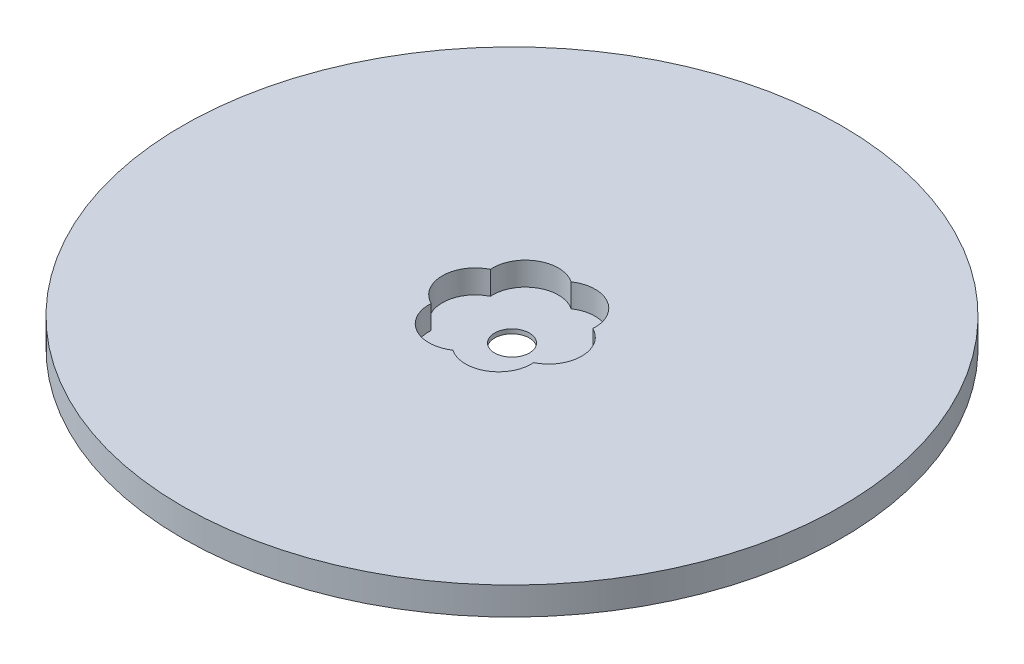
ISO-10303-21;
HEADER;
FILE_DESCRIPTION(('STEP AP214'),'2;1');
FILE_NAME('part.step','',(''),(''),'','','');
FILE_SCHEMA(('AUTOMOTIVE_DESIGN { 1 0 10303 214 1 1 1 1 }'));
ENDSEC;
DATA;
#1=APPLICATION_CONTEXT('core data for automotive mechanical design processes');
#2=APPLICATION_PROTOCOL_DEFINITION('international standard','automotive_design',2000,#1);
#3=PRODUCT_CONTEXT('',#1,'mechanical');
#4=PRODUCT('Part','Part','',(#3));
#5=PRODUCT_RELATED_PRODUCT_CATEGORY('part','',(#4));
#6=PRODUCT_DEFINITION_FORMATION('','',#4);
#7=PRODUCT_DEFINITION_CONTEXT('part definition',#1,'design');
#8=PRODUCT_DEFINITION('design','',#6,#7);
#9=PRODUCT_DEFINITION_SHAPE('','',#8);
#10=(LENGTH_UNIT() NAMED_UNIT(*) SI_UNIT(.MILLI.,.METRE.));
#11=(NAMED_UNIT(*) PLANE_ANGLE_UNIT() SI_UNIT($,.RADIAN.));
#12=(NAMED_UNIT(*) SI_UNIT($,.STERADIAN.) SOLID_ANGLE_UNIT());
#13=UNCERTAINTY_MEASURE_WITH_UNIT(LENGTH_MEASURE(1.E-05),#10,'distance_accuracy_value','');
#14=(GEOMETRIC_REPRESENTATION_CONTEXT(3) GLOBAL_UNCERTAINTY_ASSIGNED_CONTEXT((#13)) GLOBAL_UNIT_ASSIGNED_CONTEXT((#10,
#11,#12)) REPRESENTATION_CONTEXT('',''));
#15=CARTESIAN_POINT('',(0.,0.,0.));
#16=DIRECTION('',(0.,0.,1.));
#17=DIRECTION('',(1.,0.,0.));
#18=AXIS2_PLACEMENT_3D('',#15,#16,#17);
#19=CARTESIAN_POINT('',(0.,8.,0.));
#20=DIRECTION('',(0.,-1.,0.));
#21=DIRECTION('',(0.,0.,-1.));
#22=AXIS2_PLACEMENT_3D('',#19,#20,#21);
#23=CYLINDRICAL_SURFACE('',#22,5.);
#24=CARTESIAN_POINT('',(0.,0.,0.));
#25=DIRECTION('',(0.,1.,0.));
#26=DIRECTION('',(0.,0.,1.));
#27=AXIS2_PLACEMENT_3D('',#24,#25,#26);
#28=CIRCLE('',#27,5.);
#29=CARTESIAN_POINT('',(0.,0.,5.));
#30=VERTEX_POINT('',#29);
#31=EDGE_CURVE('E143',#30,#30,#28,.T.);
#32=ORIENTED_EDGE('',*,*,#31,.F.);
#33=EDGE_LOOP('',(#32));
#34=FACE_BOUND('',#33,.T.);
#35=CARTESIAN_POINT('',(0.,1.25601425030727,0.));
#36=DIRECTION('',(0.,1.,0.));
#37=DIRECTION('',(0.,0.,1.));
#38=AXIS2_PLACEMENT_3D('',#35,#36,#37);
#39=CIRCLE('',#38,5.);
#40=CARTESIAN_POINT('',(0.,1.25601425030727,5.));
#41=VERTEX_POINT('',#40);
#42=EDGE_CURVE('E11',#41,#41,#39,.T.);
#43=ORIENTED_EDGE('',*,*,#42,.T.);
#44=EDGE_LOOP('',(#43));
#45=FACE_BOUND('',#44,.T.);
#46=ADVANCED_FACE('F39',(#34,#45),#23,.F.);
#47=CARTESIAN_POINT('',(0.,8.,0.));
#48=DIRECTION('',(0.,-1.,0.));
#49=DIRECTION('',(0.,0.,-1.));
#50=AXIS2_PLACEMENT_3D('',#47,#48,#49);
#51=CYLINDRICAL_SURFACE('',#50,95.);
#52=CARTESIAN_POINT('',(0.,8.,0.));
#53=DIRECTION('',(0.,1.,0.));
#54=DIRECTION('',(0.,0.,1.));
#55=AXIS2_PLACEMENT_3D('',#52,#53,#54);
#56=CIRCLE('',#55,95.);
#57=CARTESIAN_POINT('',(0.,8.,95.));
#58=VERTEX_POINT('',#57);
#59=EDGE_CURVE('E50',#58,#58,#56,.T.);
#60=ORIENTED_EDGE('',*,*,#59,.F.);
#61=EDGE_LOOP('',(#60));
#62=FACE_BOUND('',#61,.T.);
#63=CARTESIAN_POINT('',(0.,0.,0.));
#64=DIRECTION('',(0.,1.,0.));
#65=DIRECTION('',(0.,0.,1.));
#66=AXIS2_PLACEMENT_3D('',#63,#64,#65);
#67=CIRCLE('',#66,95.);
#68=CARTESIAN_POINT('',(0.,0.,95.));
#69=VERTEX_POINT('',#68);
#70=EDGE_CURVE('E148',#69,#69,#67,.T.);
#71=ORIENTED_EDGE('',*,*,#70,.T.);
#72=EDGE_LOOP('',(#71));
#73=FACE_BOUND('',#72,.T.);
#74=ADVANCED_FACE('F41',(#62,#73),#51,.T.);
#75=CARTESIAN_POINT('',(0.,8.,0.));
#76=DIRECTION('',(0.,1.,0.));
#77=DIRECTION('',(0.,0.,1.));
#78=AXIS2_PLACEMENT_3D('',#75,#76,#77);
#79=PLANE('',#78);
#80=CARTESIAN_POINT('',(-5.29583228975181,8.,-9.17265059421371));
#81=DIRECTION('',(0.,1.,0.));
#82=DIRECTION('',(-0.866025403784433,0.,0.50000000000001));
#83=AXIS2_PLACEMENT_3D('',#80,#81,#82);
#84=CIRCLE('',#83,9.49842682799602);
#85=CARTESIAN_POINT('',(-1.77809156287623E-13,8.,-17.057717021684));
#86=VERTEX_POINT('',#85);
#87=CARTESIAN_POINT('',(-14.7724162713447,8.,-8.52885851084194));
#88=VERTEX_POINT('',#87);
#89=EDGE_CURVE('E53',#86,#88,#84,.T.);
#90=ORIENTED_EDGE('',*,*,#89,.F.);
#91=CARTESIAN_POINT('',(5.29583228975162,8.,-9.17265059421382));
#92=DIRECTION('',(0.,1.,0.));
#93=DIRECTION('',(-0.866025403784443,0.,-0.499999999999992));
#94=AXIS2_PLACEMENT_3D('',#91,#92,#93);
#95=CIRCLE('',#94,9.49842682799602);
#96=CARTESIAN_POINT('',(14.7724162713445,8.,-8.52885851084203));
#97=VERTEX_POINT('',#96);
#98=EDGE_CURVE('E106',#97,#86,#95,.T.);
#99=ORIENTED_EDGE('',*,*,#98,.F.);
#100=CARTESIAN_POINT('',(10.5916645795034,8.,0.));
#101=DIRECTION('',(0.,1.,0.));
#102=DIRECTION('',(0.,0.,-1.));
#103=AXIS2_PLACEMENT_3D('',#100,#101,#102);
#104=CIRCLE('',#103,9.49842682799602);
#105=CARTESIAN_POINT('',(14.7724162713446,8.,8.52885851084197));
#106=VERTEX_POINT('',#105);
#107=EDGE_CURVE('E104',#106,#97,#104,.T.);
#108=ORIENTED_EDGE('',*,*,#107,.F.);
#109=CARTESIAN_POINT('',(5.29583228975174,8.,9.17265059421375));
#110=DIRECTION('',(0.,1.,0.));
#111=DIRECTION('',(0.866025403784436,0.,-0.500000000000004));
#112=AXIS2_PLACEMENT_3D('',#109,#110,#111);
#113=CIRCLE('',#112,9.49842682799602);
#114=CARTESIAN_POINT('',(0.,8.,17.057717021684));
#115=VERTEX_POINT('',#114);
#116=EDGE_CURVE('E123',#115,#106,#113,.T.);
#117=ORIENTED_EDGE('',*,*,#116,.F.);
#118=CARTESIAN_POINT('',(-5.29583228975168,8.,9.17265059421378));
#119=DIRECTION('',(0.,1.,0.));
#120=DIRECTION('',(0.86602540378444,0.,0.499999999999998));
#121=AXIS2_PLACEMENT_3D('',#118,#119,#120);
#122=CIRCLE('',#121,9.49842682799602);
#123=CARTESIAN_POINT('',(-14.7724162713445,8.,8.528858510842));
#124=VERTEX_POINT('',#123);
#125=EDGE_CURVE('E135',#124,#115,#122,.T.);
#126=ORIENTED_EDGE('',*,*,#125,.F.);
#127=CARTESIAN_POINT('',(-10.5916645795034,8.,0.));
#128=DIRECTION('',(0.,1.,0.));
#129=DIRECTION('',(0.,0.,1.));
#130=AXIS2_PLACEMENT_3D('',#127,#128,#129);
#131=CIRCLE('',#130,9.49842682799602);
#132=EDGE_CURVE('E137',#88,#124,#131,.T.);
#133=ORIENTED_EDGE('',*,*,#132,.F.);
#134=EDGE_LOOP('',(#90,#99,#108,#117,#126,#133));
#135=FACE_BOUND('',#134,.T.);
#136=ORIENTED_EDGE('',*,*,#59,.T.);
#137=EDGE_LOOP('',(#136));
#138=FACE_BOUND('',#137,.T.);
#139=ADVANCED_FACE('F154',(#135,#138),#79,.T.);
#140=CARTESIAN_POINT('',(0.,0.,0.));
#141=DIRECTION('',(0.,1.,0.));
#142=DIRECTION('',(0.,0.,1.));
#143=AXIS2_PLACEMENT_3D('',#140,#141,#142);
#144=PLANE('',#143);
#145=ORIENTED_EDGE('',*,*,#31,.T.);
#146=EDGE_LOOP('',(#145));
#147=FACE_BOUND('',#146,.T.);
#148=ORIENTED_EDGE('',*,*,#70,.F.);
#149=EDGE_LOOP('',(#148));
#150=FACE_BOUND('',#149,.T.);
#151=ADVANCED_FACE('F155',(#147,#150),#144,.F.);
#152=CARTESIAN_POINT('',(-10.5916645795034,1.25601425030727,0.));
#153=DIRECTION('',(0.,1.,0.));
#154=DIRECTION('',(0.,0.,1.));
#155=AXIS2_PLACEMENT_3D('',#152,#153,#154);
#156=CYLINDRICAL_SURFACE('',#155,9.49842682799602);
#157=ORIENTED_EDGE('',*,*,#132,.T.);
#158=DIRECTION('',(0.,1.,0.));
#159=VECTOR('',#158,1.);
#160=CARTESIAN_POINT('',(-14.7724162713445,4.62800712515364,8.528858510842));
#161=LINE('',#160,#159);
#162=CARTESIAN_POINT('',(-14.7724162713445,1.25601425030727,8.528858510842));
#163=VERTEX_POINT('',#162);
#164=EDGE_CURVE('E136',#124,#163,#161,.F.);
#165=ORIENTED_EDGE('',*,*,#164,.T.);
#166=CARTESIAN_POINT('',(-10.5916645795034,1.25601425030727,0.));
#167=DIRECTION('',(0.,1.,0.));
#168=DIRECTION('',(0.,0.,1.));
#169=AXIS2_PLACEMENT_3D('',#166,#167,#168);
#170=CIRCLE('',#169,9.49842682799602);
#171=CARTESIAN_POINT('',(-14.7724162713447,1.25601425030727,-8.52885851084194));
#172=VERTEX_POINT('',#171);
#173=EDGE_CURVE('E138',#172,#163,#170,.T.);
#174=ORIENTED_EDGE('',*,*,#173,.F.);
#175=DIRECTION('',(0.,1.,0.));
#176=VECTOR('',#175,1.);
#177=CARTESIAN_POINT('',(-14.7724162713447,4.62800712515364,-8.52885851084194));
#178=LINE('',#177,#176);
#179=EDGE_CURVE('E114',#172,#88,#178,.T.);
#180=ORIENTED_EDGE('',*,*,#179,.T.);
#181=EDGE_LOOP('',(#157,#165,#174,#180));
#182=FACE_BOUND('',#181,.T.);
#183=ADVANCED_FACE('F152',(#182),#156,.F.);
#184=CARTESIAN_POINT('',(-10.5916645795034,1.25601425030727,0.));
#185=DIRECTION('',(0.,1.,0.));
#186=DIRECTION('',(0.,0.,1.));
#187=AXIS2_PLACEMENT_3D('',#184,#185,#186);
#188=PLANE('',#187);
#189=ORIENTED_EDGE('',*,*,#173,.T.);
#190=CARTESIAN_POINT('',(-5.29583228975168,1.25601425030727,9.17265059421378));
#191=DIRECTION('',(0.,1.,0.));
#192=DIRECTION('',(0.86602540378444,0.,0.499999999999998));
#193=AXIS2_PLACEMENT_3D('',#190,#191,#192);
#194=CIRCLE('',#193,9.49842682799602);
#195=CARTESIAN_POINT('',(0.,1.25601425030727,17.057717021684));
#196=VERTEX_POINT('',#195);
#197=EDGE_CURVE('E65',#163,#196,#194,.T.);
#198=ORIENTED_EDGE('',*,*,#197,.T.);
#199=CARTESIAN_POINT('',(5.29583228975174,1.25601425030727,9.17265059421375));
#200=DIRECTION('',(0.,1.,0.));
#201=DIRECTION('',(0.866025403784436,0.,-0.500000000000004));
#202=AXIS2_PLACEMENT_3D('',#199,#200,#201);
#203=CIRCLE('',#202,9.49842682799602);
#204=CARTESIAN_POINT('',(14.7724162713446,1.25601425030727,8.52885851084197));
#205=VERTEX_POINT('',#204);
#206=EDGE_CURVE('E124',#196,#205,#203,.T.);
#207=ORIENTED_EDGE('',*,*,#206,.T.);
#208=CARTESIAN_POINT('',(10.5916645795034,1.25601425030727,0.));
#209=DIRECTION('',(0.,1.,0.));
#210=DIRECTION('',(0.,0.,-1.));
#211=AXIS2_PLACEMENT_3D('',#208,#209,#210);
#212=CIRCLE('',#211,9.49842682799602);
#213=CARTESIAN_POINT('',(14.7724162713445,1.25601425030727,-8.52885851084203));
#214=VERTEX_POINT('',#213);
#215=EDGE_CURVE('E105',#205,#214,#212,.T.);
#216=ORIENTED_EDGE('',*,*,#215,.T.);
#217=CARTESIAN_POINT('',(5.29583228975162,1.25601425030727,-9.17265059421382));
#218=DIRECTION('',(0.,1.,0.));
#219=DIRECTION('',(-0.866025403784443,0.,-0.499999999999992));
#220=AXIS2_PLACEMENT_3D('',#217,#218,#219);
#221=CIRCLE('',#220,9.49842682799602);
#222=CARTESIAN_POINT('',(-1.77809156287623E-13,1.25601425030727,-17.057717021684));
#223=VERTEX_POINT('',#222);
#224=EDGE_CURVE('E91',#214,#223,#221,.T.);
#225=ORIENTED_EDGE('',*,*,#224,.T.);
#226=CARTESIAN_POINT('',(-5.29583228975181,1.25601425030727,-9.17265059421371));
#227=DIRECTION('',(0.,1.,0.));
#228=DIRECTION('',(-0.866025403784433,0.,0.50000000000001));
#229=AXIS2_PLACEMENT_3D('',#226,#227,#228);
#230=CIRCLE('',#229,9.49842682799602);
#231=EDGE_CURVE('E97',#223,#172,#230,.T.);
#232=ORIENTED_EDGE('',*,*,#231,.T.);
#233=EDGE_LOOP('',(#189,#198,#207,#216,#225,#232));
#234=FACE_BOUND('',#233,.T.);
#235=ORIENTED_EDGE('',*,*,#42,.F.);
#236=EDGE_LOOP('',(#235));
#237=FACE_BOUND('',#236,.T.);
#238=ADVANCED_FACE('F96',(#234,#237),#188,.T.);
#239=CARTESIAN_POINT('',(-5.29583228975168,1.25601425030727,9.17265059421378));
#240=DIRECTION('',(0.,1.,0.));
#241=DIRECTION('',(0.,0.,1.));
#242=AXIS2_PLACEMENT_3D('',#239,#240,#241);
#243=CYLINDRICAL_SURFACE('',#242,9.49842682799602);
#244=ORIENTED_EDGE('',*,*,#125,.T.);
#245=DIRECTION('',(0.,1.,0.));
#246=VECTOR('',#245,1.);
#247=CARTESIAN_POINT('',(0.,4.62800712515364,17.057717021684));
#248=LINE('',#247,#246);
#249=EDGE_CURVE('E128',#115,#196,#248,.F.);
#250=ORIENTED_EDGE('',*,*,#249,.T.);
#251=ORIENTED_EDGE('',*,*,#197,.F.);
#252=ORIENTED_EDGE('',*,*,#164,.F.);
#253=EDGE_LOOP('',(#244,#250,#251,#252));
#254=FACE_BOUND('',#253,.T.);
#255=ADVANCED_FACE('F180',(#254),#243,.F.);
#256=CARTESIAN_POINT('',(-5.29583228975181,1.25601425030727,-9.17265059421371));
#257=DIRECTION('',(0.,1.,0.));
#258=DIRECTION('',(0.,0.,1.));
#259=AXIS2_PLACEMENT_3D('',#256,#257,#258);
#260=CYLINDRICAL_SURFACE('',#259,9.49842682799602);
#261=ORIENTED_EDGE('',*,*,#231,.F.);
#262=DIRECTION('',(0.,1.,0.));
#263=VECTOR('',#262,1.);
#264=CARTESIAN_POINT('',(-1.77809156287623E-13,4.62800712515364,-17.057717021684));
#265=LINE('',#264,#263);
#266=EDGE_CURVE('E107',#86,#223,#265,.F.);
#267=ORIENTED_EDGE('',*,*,#266,.F.);
#268=ORIENTED_EDGE('',*,*,#89,.T.);
#269=ORIENTED_EDGE('',*,*,#179,.F.);
#270=EDGE_LOOP('',(#261,#267,#268,#269));
#271=FACE_BOUND('',#270,.T.);
#272=ADVANCED_FACE('F115',(#271),#260,.F.);
#273=CARTESIAN_POINT('',(5.29583228975174,1.25601425030727,9.17265059421375));
#274=DIRECTION('',(0.,1.,0.));
#275=DIRECTION('',(0.,0.,1.));
#276=AXIS2_PLACEMENT_3D('',#273,#274,#275);
#277=CYLINDRICAL_SURFACE('',#276,9.49842682799602);
#278=ORIENTED_EDGE('',*,*,#116,.T.);
#279=DIRECTION('',(0.,1.,0.));
#280=VECTOR('',#279,1.);
#281=CARTESIAN_POINT('',(14.7724162713446,4.62800712515364,8.52885851084197));
#282=LINE('',#281,#280);
#283=EDGE_CURVE('E118',#106,#205,#282,.F.);
#284=ORIENTED_EDGE('',*,*,#283,.T.);
#285=ORIENTED_EDGE('',*,*,#206,.F.);
#286=ORIENTED_EDGE('',*,*,#249,.F.);
#287=EDGE_LOOP('',(#278,#284,#285,#286));
#288=FACE_BOUND('',#287,.T.);
#289=ADVANCED_FACE('F179',(#288),#277,.F.);
#290=CARTESIAN_POINT('',(10.5916645795034,1.25601425030727,0.));
#291=DIRECTION('',(0.,1.,0.));
#292=DIRECTION('',(0.,0.,1.));
#293=AXIS2_PLACEMENT_3D('',#290,#291,#292);
#294=CYLINDRICAL_SURFACE('',#293,9.49842682799602);
#295=DIRECTION('',(0.,1.,0.));
#296=VECTOR('',#295,1.);
#297=CARTESIAN_POINT('',(14.7724162713445,4.62800712515364,-8.52885851084203));
#298=LINE('',#297,#296);
#299=EDGE_CURVE('E130',#97,#214,#298,.F.);
#300=ORIENTED_EDGE('',*,*,#299,.T.);
#301=ORIENTED_EDGE('',*,*,#215,.F.);
#302=ORIENTED_EDGE('',*,*,#283,.F.);
#303=ORIENTED_EDGE('',*,*,#107,.T.);
#304=EDGE_LOOP('',(#300,#301,#302,#303));
#305=FACE_BOUND('',#304,.T.);
#306=ADVANCED_FACE('F181',(#305),#294,.F.);
#307=CARTESIAN_POINT('',(5.29583228975162,1.25601425030727,-9.17265059421382));
#308=DIRECTION('',(0.,1.,0.));
#309=DIRECTION('',(0.,0.,1.));
#310=AXIS2_PLACEMENT_3D('',#307,#308,#309);
#311=CYLINDRICAL_SURFACE('',#310,9.49842682799602);
#312=ORIENTED_EDGE('',*,*,#98,.T.);
#313=ORIENTED_EDGE('',*,*,#266,.T.);
#314=ORIENTED_EDGE('',*,*,#224,.F.);
#315=ORIENTED_EDGE('',*,*,#299,.F.);
#316=EDGE_LOOP('',(#312,#313,#314,#315));
#317=FACE_BOUND('',#316,.T.);
#318=ADVANCED_FACE('F108',(#317),#311,.F.);
#319=CLOSED_SHELL('',(#46,#74,#139,#151,#183,#238,#255,#272,#289,#306,#318));
#320=MANIFOLD_SOLID_BREP('B2',#319);
#321=ADVANCED_BREP_SHAPE_REPRESENTATION('',(#18,#320),#14);
#322=SHAPE_DEFINITION_REPRESENTATION(#9,#321);
ENDSEC;
END-ISO-10303-21;
